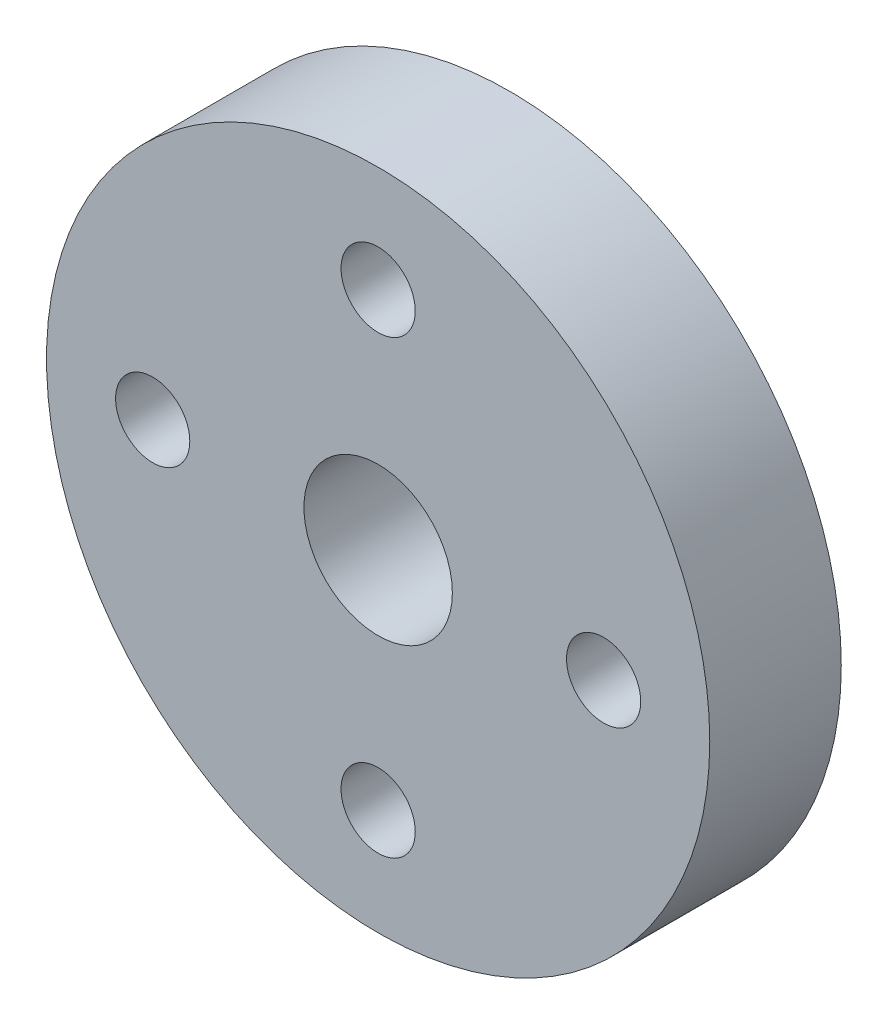
ISO-10303-21;
HEADER;
FILE_DESCRIPTION(('STEP AP214'),'2;1');
FILE_NAME('part.step','',(''),(''),'','','');
FILE_SCHEMA(('AUTOMOTIVE_DESIGN { 1 0 10303 214 1 1 1 1 }'));
ENDSEC;
DATA;
#1=APPLICATION_CONTEXT('core data for automotive mechanical design processes');
#2=APPLICATION_PROTOCOL_DEFINITION('international standard','automotive_design',2000,#1);
#3=PRODUCT_CONTEXT('',#1,'mechanical');
#4=PRODUCT('Part','Part','',(#3));
#5=PRODUCT_RELATED_PRODUCT_CATEGORY('part','',(#4));
#6=PRODUCT_DEFINITION_FORMATION('','',#4);
#7=PRODUCT_DEFINITION_CONTEXT('part definition',#1,'design');
#8=PRODUCT_DEFINITION('design','',#6,#7);
#9=PRODUCT_DEFINITION_SHAPE('','',#8);
#10=(LENGTH_UNIT() NAMED_UNIT(*) SI_UNIT(.MILLI.,.METRE.));
#11=(NAMED_UNIT(*) PLANE_ANGLE_UNIT() SI_UNIT($,.RADIAN.));
#12=(NAMED_UNIT(*) SI_UNIT($,.STERADIAN.) SOLID_ANGLE_UNIT());
#13=UNCERTAINTY_MEASURE_WITH_UNIT(LENGTH_MEASURE(1.E-05),#10,'distance_accuracy_value','');
#14=(GEOMETRIC_REPRESENTATION_CONTEXT(3) GLOBAL_UNCERTAINTY_ASSIGNED_CONTEXT((#13)) GLOBAL_UNIT_ASSIGNED_CONTEXT((#10,
#11,#12)) REPRESENTATION_CONTEXT('',''));
#15=CARTESIAN_POINT('',(0.,0.,0.));
#16=DIRECTION('',(0.,0.,1.));
#17=DIRECTION('',(1.,0.,0.));
#18=AXIS2_PLACEMENT_3D('',#15,#16,#17);
#19=CARTESIAN_POINT('',(0.,0.,7.));
#20=DIRECTION('',(0.,0.,1.));
#21=DIRECTION('',(1.,0.,0.));
#22=AXIS2_PLACEMENT_3D('',#19,#20,#21);
#23=PLANE('',#22);
#24=CARTESIAN_POINT('',(6.77712297852766E-13,-12.,7.));
#25=DIRECTION('',(0.,0.,1.));
#26=DIRECTION('',(1.,0.,0.));
#27=AXIS2_PLACEMENT_3D('',#24,#25,#26);
#28=CIRCLE('',#27,1.97500000000073);
#29=CARTESIAN_POINT('',(1.97500000000141,-12.,7.));
#30=VERTEX_POINT('',#29);
#31=EDGE_CURVE('E59',#30,#30,#28,.T.);
#32=ORIENTED_EDGE('',*,*,#31,.F.);
#33=EDGE_LOOP('',(#32));
#34=FACE_BOUND('',#33,.T.);
#35=CARTESIAN_POINT('',(0.,12.,7.));
#36=DIRECTION('',(0.,0.,1.));
#37=DIRECTION('',(1.,0.,0.));
#38=AXIS2_PLACEMENT_3D('',#35,#36,#37);
#39=CIRCLE('',#38,1.975);
#40=CARTESIAN_POINT('',(1.975,12.,7.));
#41=VERTEX_POINT('',#40);
#42=EDGE_CURVE('E47',#41,#41,#39,.T.);
#43=ORIENTED_EDGE('',*,*,#42,.F.);
#44=EDGE_LOOP('',(#43));
#45=FACE_BOUND('',#44,.T.);
#46=CARTESIAN_POINT('',(0.,0.,7.));
#47=DIRECTION('',(0.,0.,1.));
#48=DIRECTION('',(1.,0.,0.));
#49=AXIS2_PLACEMENT_3D('',#46,#47,#48);
#50=CIRCLE('',#49,17.65);
#51=CARTESIAN_POINT('',(17.65,0.,7.));
#52=VERTEX_POINT('',#51);
#53=EDGE_CURVE('E10',#52,#52,#50,.T.);
#54=ORIENTED_EDGE('',*,*,#53,.T.);
#55=EDGE_LOOP('',(#54));
#56=FACE_BOUND('',#55,.T.);
#57=CARTESIAN_POINT('',(0.,0.,7.));
#58=DIRECTION('',(0.,0.,1.));
#59=DIRECTION('',(1.,0.,0.));
#60=AXIS2_PLACEMENT_3D('',#57,#58,#59);
#61=CIRCLE('',#60,3.95);
#62=CARTESIAN_POINT('',(3.95,0.,7.));
#63=VERTEX_POINT('',#62);
#64=EDGE_CURVE('E42',#63,#63,#61,.T.);
#65=ORIENTED_EDGE('',*,*,#64,.F.);
#66=EDGE_LOOP('',(#65));
#67=FACE_BOUND('',#66,.T.);
#68=CARTESIAN_POINT('',(12.0000000000003,3.38856148926383E-13,7.));
#69=DIRECTION('',(0.,0.,1.));
#70=DIRECTION('',(1.,0.,0.));
#71=AXIS2_PLACEMENT_3D('',#68,#69,#70);
#72=CIRCLE('',#71,1.97500000000027);
#73=CARTESIAN_POINT('',(13.9750000000006,3.38856148926383E-13,7.));
#74=VERTEX_POINT('',#73);
#75=EDGE_CURVE('E53',#74,#74,#72,.T.);
#76=ORIENTED_EDGE('',*,*,#75,.F.);
#77=EDGE_LOOP('',(#76));
#78=FACE_BOUND('',#77,.T.);
#79=CARTESIAN_POINT('',(-11.9999999999997,-3.4032572508536E-13,7.));
#80=DIRECTION('',(0.,0.,1.));
#81=DIRECTION('',(1.,0.,0.));
#82=AXIS2_PLACEMENT_3D('',#79,#80,#81);
#83=CIRCLE('',#82,1.97500000000055);
#84=CARTESIAN_POINT('',(-10.0249999999991,-3.4032572508536E-13,7.));
#85=VERTEX_POINT('',#84);
#86=EDGE_CURVE('E65',#85,#85,#83,.T.);
#87=ORIENTED_EDGE('',*,*,#86,.F.);
#88=EDGE_LOOP('',(#87));
#89=FACE_BOUND('',#88,.T.);
#90=ADVANCED_FACE('F31',(#34,#45,#56,#67,#78,#89),#23,.T.);
#91=CARTESIAN_POINT('',(0.,0.,0.));
#92=DIRECTION('',(0.,0.,1.));
#93=DIRECTION('',(1.,0.,0.));
#94=AXIS2_PLACEMENT_3D('',#91,#92,#93);
#95=PLANE('',#94);
#96=CARTESIAN_POINT('',(0.,0.,0.));
#97=DIRECTION('',(0.,0.,1.));
#98=DIRECTION('',(1.,0.,0.));
#99=AXIS2_PLACEMENT_3D('',#96,#97,#98);
#100=CIRCLE('',#99,17.65);
#101=CARTESIAN_POINT('',(17.65,0.,0.));
#102=VERTEX_POINT('',#101);
#103=EDGE_CURVE('E35',#102,#102,#100,.T.);
#104=ORIENTED_EDGE('',*,*,#103,.F.);
#105=EDGE_LOOP('',(#104));
#106=FACE_BOUND('',#105,.T.);
#107=CARTESIAN_POINT('',(0.,0.,0.));
#108=DIRECTION('',(0.,0.,1.));
#109=DIRECTION('',(1.,0.,0.));
#110=AXIS2_PLACEMENT_3D('',#107,#108,#109);
#111=CIRCLE('',#110,3.95);
#112=CARTESIAN_POINT('',(3.95,0.,0.));
#113=VERTEX_POINT('',#112);
#114=EDGE_CURVE('E44',#113,#113,#111,.T.);
#115=ORIENTED_EDGE('',*,*,#114,.T.);
#116=EDGE_LOOP('',(#115));
#117=FACE_BOUND('',#116,.T.);
#118=CARTESIAN_POINT('',(0.,12.,0.));
#119=DIRECTION('',(0.,0.,1.));
#120=DIRECTION('',(1.,0.,0.));
#121=AXIS2_PLACEMENT_3D('',#118,#119,#120);
#122=CIRCLE('',#121,1.975);
#123=CARTESIAN_POINT('',(1.975,12.,0.));
#124=VERTEX_POINT('',#123);
#125=EDGE_CURVE('E50',#124,#124,#122,.T.);
#126=ORIENTED_EDGE('',*,*,#125,.T.);
#127=EDGE_LOOP('',(#126));
#128=FACE_BOUND('',#127,.T.);
#129=CARTESIAN_POINT('',(12.0000000000003,3.38856148926383E-13,0.));
#130=DIRECTION('',(0.,0.,1.));
#131=DIRECTION('',(1.,0.,0.));
#132=AXIS2_PLACEMENT_3D('',#129,#130,#131);
#133=CIRCLE('',#132,1.97500000000027);
#134=CARTESIAN_POINT('',(13.9750000000006,3.38856148926383E-13,0.));
#135=VERTEX_POINT('',#134);
#136=EDGE_CURVE('E56',#135,#135,#133,.T.);
#137=ORIENTED_EDGE('',*,*,#136,.T.);
#138=EDGE_LOOP('',(#137));
#139=FACE_BOUND('',#138,.T.);
#140=CARTESIAN_POINT('',(6.77712297852766E-13,-12.,0.));
#141=DIRECTION('',(0.,0.,1.));
#142=DIRECTION('',(1.,0.,0.));
#143=AXIS2_PLACEMENT_3D('',#140,#141,#142);
#144=CIRCLE('',#143,1.97500000000073);
#145=CARTESIAN_POINT('',(1.97500000000141,-12.,0.));
#146=VERTEX_POINT('',#145);
#147=EDGE_CURVE('E62',#146,#146,#144,.T.);
#148=ORIENTED_EDGE('',*,*,#147,.T.);
#149=EDGE_LOOP('',(#148));
#150=FACE_BOUND('',#149,.T.);
#151=CARTESIAN_POINT('',(-11.9999999999997,-3.4032572508536E-13,0.));
#152=DIRECTION('',(0.,0.,1.));
#153=DIRECTION('',(1.,0.,0.));
#154=AXIS2_PLACEMENT_3D('',#151,#152,#153);
#155=CIRCLE('',#154,1.97500000000055);
#156=CARTESIAN_POINT('',(-10.0249999999991,-3.4032572508536E-13,0.));
#157=VERTEX_POINT('',#156);
#158=EDGE_CURVE('E68',#157,#157,#155,.T.);
#159=ORIENTED_EDGE('',*,*,#158,.T.);
#160=EDGE_LOOP('',(#159));
#161=FACE_BOUND('',#160,.T.);
#162=ADVANCED_FACE('F78',(#106,#117,#128,#139,#150,#161),#95,.F.);
#163=CARTESIAN_POINT('',(0.,0.,7.));
#164=DIRECTION('',(0.,0.,-1.));
#165=DIRECTION('',(-1.,0.,0.));
#166=AXIS2_PLACEMENT_3D('',#163,#164,#165);
#167=CYLINDRICAL_SURFACE('',#166,17.65);
#168=ORIENTED_EDGE('',*,*,#53,.F.);
#169=EDGE_LOOP('',(#168));
#170=FACE_BOUND('',#169,.T.);
#171=ORIENTED_EDGE('',*,*,#103,.T.);
#172=EDGE_LOOP('',(#171));
#173=FACE_BOUND('',#172,.T.);
#174=ADVANCED_FACE('F33',(#170,#173),#167,.T.);
#175=CARTESIAN_POINT('',(0.,0.,7.));
#176=DIRECTION('',(0.,0.,-1.));
#177=DIRECTION('',(-1.,0.,0.));
#178=AXIS2_PLACEMENT_3D('',#175,#176,#177);
#179=CYLINDRICAL_SURFACE('',#178,3.95);
#180=ORIENTED_EDGE('',*,*,#64,.T.);
#181=EDGE_LOOP('',(#180));
#182=FACE_BOUND('',#181,.T.);
#183=ORIENTED_EDGE('',*,*,#114,.F.);
#184=EDGE_LOOP('',(#183));
#185=FACE_BOUND('',#184,.T.);
#186=ADVANCED_FACE('F88',(#182,#185),#179,.F.);
#187=CARTESIAN_POINT('',(0.,12.,7.));
#188=DIRECTION('',(0.,0.,-1.));
#189=DIRECTION('',(-1.,0.,0.));
#190=AXIS2_PLACEMENT_3D('',#187,#188,#189);
#191=CYLINDRICAL_SURFACE('',#190,1.975);
#192=ORIENTED_EDGE('',*,*,#42,.T.);
#193=EDGE_LOOP('',(#192));
#194=FACE_BOUND('',#193,.T.);
#195=ORIENTED_EDGE('',*,*,#125,.F.);
#196=EDGE_LOOP('',(#195));
#197=FACE_BOUND('',#196,.T.);
#198=ADVANCED_FACE('F91',(#194,#197),#191,.F.);
#199=CARTESIAN_POINT('',(12.0000000000003,3.38856148926383E-13,7.));
#200=DIRECTION('',(0.,0.,-1.));
#201=DIRECTION('',(-1.,0.,0.));
#202=AXIS2_PLACEMENT_3D('',#199,#200,#201);
#203=CYLINDRICAL_SURFACE('',#202,1.97500000000027);
#204=ORIENTED_EDGE('',*,*,#75,.T.);
#205=EDGE_LOOP('',(#204));
#206=FACE_BOUND('',#205,.T.);
#207=ORIENTED_EDGE('',*,*,#136,.F.);
#208=EDGE_LOOP('',(#207));
#209=FACE_BOUND('',#208,.T.);
#210=ADVANCED_FACE('F95',(#206,#209),#203,.F.);
#211=CARTESIAN_POINT('',(6.77712297852766E-13,-12.,7.));
#212=DIRECTION('',(0.,0.,-1.));
#213=DIRECTION('',(-1.,0.,0.));
#214=AXIS2_PLACEMENT_3D('',#211,#212,#213);
#215=CYLINDRICAL_SURFACE('',#214,1.97500000000073);
#216=ORIENTED_EDGE('',*,*,#31,.T.);
#217=EDGE_LOOP('',(#216));
#218=FACE_BOUND('',#217,.T.);
#219=ORIENTED_EDGE('',*,*,#147,.F.);
#220=EDGE_LOOP('',(#219));
#221=FACE_BOUND('',#220,.T.);
#222=ADVANCED_FACE('F99',(#218,#221),#215,.F.);
#223=CARTESIAN_POINT('',(-11.9999999999997,-3.4032572508536E-13,7.));
#224=DIRECTION('',(0.,0.,-1.));
#225=DIRECTION('',(-1.,0.,0.));
#226=AXIS2_PLACEMENT_3D('',#223,#224,#225);
#227=CYLINDRICAL_SURFACE('',#226,1.97500000000055);
#228=ORIENTED_EDGE('',*,*,#86,.T.);
#229=EDGE_LOOP('',(#228));
#230=FACE_BOUND('',#229,.T.);
#231=ORIENTED_EDGE('',*,*,#158,.F.);
#232=EDGE_LOOP('',(#231));
#233=FACE_BOUND('',#232,.T.);
#234=ADVANCED_FACE('F74',(#230,#233),#227,.F.);
#235=CLOSED_SHELL('',(#90,#162,#174,#186,#198,#210,#222,#234));
#236=MANIFOLD_SOLID_BREP('B2',#235);
#237=ADVANCED_BREP_SHAPE_REPRESENTATION('',(#18,#236),#14);
#238=SHAPE_DEFINITION_REPRESENTATION(#9,#237);
ENDSEC;
END-ISO-10303-21;
